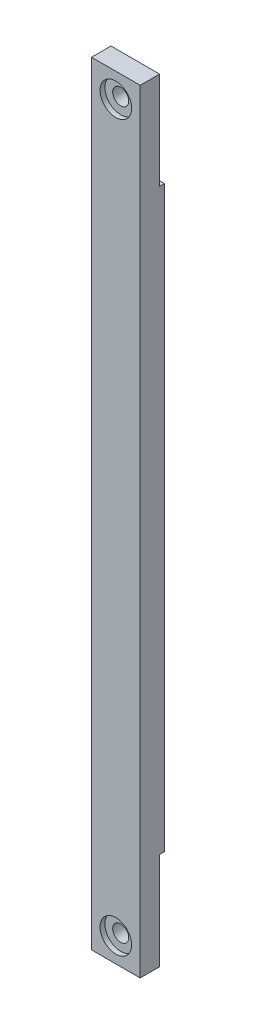
ISO-10303-21;
HEADER;
FILE_DESCRIPTION(('STEP AP214'),'2;1');
FILE_NAME('part.step','',(''),(''),'','','');
FILE_SCHEMA(('AUTOMOTIVE_DESIGN { 1 0 10303 214 1 1 1 1 }'));
ENDSEC;
DATA;
#1=APPLICATION_CONTEXT('core data for automotive mechanical design processes');
#2=APPLICATION_PROTOCOL_DEFINITION('international standard','automotive_design',2000,#1);
#3=PRODUCT_CONTEXT('',#1,'mechanical');
#4=PRODUCT('Part','Part','',(#3));
#5=PRODUCT_RELATED_PRODUCT_CATEGORY('part','',(#4));
#6=PRODUCT_DEFINITION_FORMATION('','',#4);
#7=PRODUCT_DEFINITION_CONTEXT('part definition',#1,'design');
#8=PRODUCT_DEFINITION('design','',#6,#7);
#9=PRODUCT_DEFINITION_SHAPE('','',#8);
#10=(LENGTH_UNIT() NAMED_UNIT(*) SI_UNIT(.MILLI.,.METRE.));
#11=(NAMED_UNIT(*) PLANE_ANGLE_UNIT() SI_UNIT($,.RADIAN.));
#12=(NAMED_UNIT(*) SI_UNIT($,.STERADIAN.) SOLID_ANGLE_UNIT());
#13=UNCERTAINTY_MEASURE_WITH_UNIT(LENGTH_MEASURE(1.E-05),#10,'distance_accuracy_value','');
#14=(GEOMETRIC_REPRESENTATION_CONTEXT(3) GLOBAL_UNCERTAINTY_ASSIGNED_CONTEXT((#13)) GLOBAL_UNIT_ASSIGNED_CONTEXT((#10,
#11,#12)) REPRESENTATION_CONTEXT('',''));
#15=CARTESIAN_POINT('',(0.,0.,0.));
#16=DIRECTION('',(0.,0.,1.));
#17=DIRECTION('',(1.,0.,0.));
#18=AXIS2_PLACEMENT_3D('',#15,#16,#17);
#19=CARTESIAN_POINT('',(5.00000000000001,-154.,5.));
#20=DIRECTION('',(0.,0.,1.));
#21=DIRECTION('',(1.,0.,0.));
#22=AXIS2_PLACEMENT_3D('',#19,#20,#21);
#23=CYLINDRICAL_SURFACE('',#22,1.65);
#24=CARTESIAN_POINT('',(5.00000000000001,-154.,1.));
#25=DIRECTION('',(0.,0.,1.));
#26=DIRECTION('',(1.,0.,0.));
#27=AXIS2_PLACEMENT_3D('',#24,#25,#26);
#28=CIRCLE('',#27,1.65);
#29=CARTESIAN_POINT('',(6.65000000000001,-154.,1.));
#30=VERTEX_POINT('',#29);
#31=EDGE_CURVE('E159',#30,#30,#28,.T.);
#32=ORIENTED_EDGE('',*,*,#31,.F.);
#33=EDGE_LOOP('',(#32));
#34=FACE_BOUND('',#33,.T.);
#35=CARTESIAN_POINT('',(5.00000000000001,-154.,4.));
#36=DIRECTION('',(0.,0.,1.));
#37=DIRECTION('',(1.,0.,0.));
#38=AXIS2_PLACEMENT_3D('',#35,#36,#37);
#39=CIRCLE('',#38,1.65);
#40=CARTESIAN_POINT('',(6.65000000000001,-154.,4.));
#41=VERTEX_POINT('',#40);
#42=EDGE_CURVE('E45',#41,#41,#39,.F.);
#43=ORIENTED_EDGE('',*,*,#42,.F.);
#44=EDGE_LOOP('',(#43));
#45=FACE_BOUND('',#44,.T.);
#46=ADVANCED_FACE('F41',(#34,#45),#23,.F.);
#47=CARTESIAN_POINT('',(5.00000000000001,-5.,5.));
#48=DIRECTION('',(0.,0.,1.));
#49=DIRECTION('',(1.,0.,0.));
#50=AXIS2_PLACEMENT_3D('',#47,#48,#49);
#51=CYLINDRICAL_SURFACE('',#50,1.65);
#52=CARTESIAN_POINT('',(5.00000000000001,-5.,1.));
#53=DIRECTION('',(0.,0.,-1.));
#54=DIRECTION('',(-1.,0.,0.));
#55=AXIS2_PLACEMENT_3D('',#52,#53,#54);
#56=CIRCLE('',#55,1.65);
#57=CARTESIAN_POINT('',(3.35000000000001,-5.,1.));
#58=VERTEX_POINT('',#57);
#59=EDGE_CURVE('E195',#58,#58,#56,.T.);
#60=ORIENTED_EDGE('',*,*,#59,.T.);
#61=EDGE_LOOP('',(#60));
#62=FACE_BOUND('',#61,.T.);
#63=CARTESIAN_POINT('',(5.00000000000001,-5.,4.));
#64=DIRECTION('',(0.,0.,1.));
#65=DIRECTION('',(1.,0.,0.));
#66=AXIS2_PLACEMENT_3D('',#63,#64,#65);
#67=CIRCLE('',#66,1.65);
#68=CARTESIAN_POINT('',(6.65000000000001,-5.,4.));
#69=VERTEX_POINT('',#68);
#70=EDGE_CURVE('E196',#69,#69,#67,.F.);
#71=ORIENTED_EDGE('',*,*,#70,.F.);
#72=EDGE_LOOP('',(#71));
#73=FACE_BOUND('',#72,.T.);
#74=ADVANCED_FACE('F250',(#62,#73),#51,.F.);
#75=CARTESIAN_POINT('',(0.,0.,5.));
#76=DIRECTION('',(0.,-1.,0.));
#77=DIRECTION('',(0.,0.,-1.));
#78=AXIS2_PLACEMENT_3D('',#75,#76,#77);
#79=PLANE('',#78);
#80=DIRECTION('',(1.,0.,0.));
#81=VECTOR('',#80,1.);
#82=CARTESIAN_POINT('',(10.,0.,1.));
#83=LINE('',#82,#81);
#84=CARTESIAN_POINT('',(0.,0.,1.));
#85=VERTEX_POINT('',#84);
#86=CARTESIAN_POINT('',(10.,0.,1.));
#87=VERTEX_POINT('',#86);
#88=EDGE_CURVE('E122',#85,#87,#83,.T.);
#89=ORIENTED_EDGE('',*,*,#88,.F.);
#90=DIRECTION('',(0.,0.,-1.));
#91=VECTOR('',#90,1.);
#92=CARTESIAN_POINT('',(0.,0.,5.));
#93=LINE('',#92,#91);
#94=CARTESIAN_POINT('',(0.,0.,5.));
#95=VERTEX_POINT('',#94);
#96=EDGE_CURVE('E178',#95,#85,#93,.T.);
#97=ORIENTED_EDGE('',*,*,#96,.F.);
#98=DIRECTION('',(-1.,0.,0.));
#99=VECTOR('',#98,1.);
#100=CARTESIAN_POINT('',(0.,0.,5.));
#101=LINE('',#100,#99);
#102=CARTESIAN_POINT('',(10.,0.,5.));
#103=VERTEX_POINT('',#102);
#104=EDGE_CURVE('E175',#103,#95,#101,.T.);
#105=ORIENTED_EDGE('',*,*,#104,.F.);
#106=DIRECTION('',(0.,0.,-1.));
#107=VECTOR('',#106,1.);
#108=CARTESIAN_POINT('',(10.,0.,5.));
#109=LINE('',#108,#107);
#110=EDGE_CURVE('E187',#103,#87,#109,.T.);
#111=ORIENTED_EDGE('',*,*,#110,.T.);
#112=EDGE_LOOP('',(#89,#97,#105,#111));
#113=FACE_BOUND('',#112,.T.);
#114=ADVANCED_FACE('F248',(#113),#79,.F.);
#115=CARTESIAN_POINT('',(0.,0.,5.));
#116=DIRECTION('',(1.,0.,0.));
#117=DIRECTION('',(0.,1.,0.));
#118=AXIS2_PLACEMENT_3D('',#115,#116,#117);
#119=PLANE('',#118);
#120=DIRECTION('',(0.,1.,0.));
#121=VECTOR('',#120,1.);
#122=CARTESIAN_POINT('',(0.,0.,1.));
#123=LINE('',#122,#121);
#124=CARTESIAN_POINT('',(0.,-20.,1.));
#125=VERTEX_POINT('',#124);
#126=EDGE_CURVE('E116',#125,#85,#123,.T.);
#127=ORIENTED_EDGE('',*,*,#126,.F.);
#128=DIRECTION('',(0.,0.,-1.));
#129=VECTOR('',#128,1.);
#130=CARTESIAN_POINT('',(0.,-20.,1.));
#131=LINE('',#130,#129);
#132=CARTESIAN_POINT('',(0.,-20.,0.));
#133=VERTEX_POINT('',#132);
#134=EDGE_CURVE('E112',#125,#133,#131,.T.);
#135=ORIENTED_EDGE('',*,*,#134,.T.);
#136=DIRECTION('',(0.,-1.,0.));
#137=VECTOR('',#136,1.);
#138=CARTESIAN_POINT('',(0.,0.,0.));
#139=LINE('',#138,#137);
#140=CARTESIAN_POINT('',(0.,-139.,0.));
#141=VERTEX_POINT('',#140);
#142=EDGE_CURVE('E138',#133,#141,#139,.T.);
#143=ORIENTED_EDGE('',*,*,#142,.T.);
#144=DIRECTION('',(0.,0.,-1.));
#145=VECTOR('',#144,1.);
#146=CARTESIAN_POINT('',(0.,-139.,1.));
#147=LINE('',#146,#145);
#148=CARTESIAN_POINT('',(0.,-139.,1.));
#149=VERTEX_POINT('',#148);
#150=EDGE_CURVE('E67',#149,#141,#147,.T.);
#151=ORIENTED_EDGE('',*,*,#150,.F.);
#152=DIRECTION('',(0.,1.,0.));
#153=VECTOR('',#152,1.);
#154=CARTESIAN_POINT('',(0.,-159.,1.));
#155=LINE('',#154,#153);
#156=CARTESIAN_POINT('',(0.,-159.,1.));
#157=VERTEX_POINT('',#156);
#158=EDGE_CURVE('E150',#157,#149,#155,.T.);
#159=ORIENTED_EDGE('',*,*,#158,.F.);
#160=DIRECTION('',(0.,0.,-1.));
#161=VECTOR('',#160,1.);
#162=CARTESIAN_POINT('',(0.,-159.,5.));
#163=LINE('',#162,#161);
#164=CARTESIAN_POINT('',(0.,-159.,5.));
#165=VERTEX_POINT('',#164);
#166=EDGE_CURVE('E11',#165,#157,#163,.T.);
#167=ORIENTED_EDGE('',*,*,#166,.F.);
#168=DIRECTION('',(0.,-1.,0.));
#169=VECTOR('',#168,1.);
#170=CARTESIAN_POINT('',(0.,0.,5.));
#171=LINE('',#170,#169);
#172=EDGE_CURVE('E165',#95,#165,#171,.T.);
#173=ORIENTED_EDGE('',*,*,#172,.F.);
#174=ORIENTED_EDGE('',*,*,#96,.T.);
#175=EDGE_LOOP('',(#127,#135,#143,#151,#159,#167,#173,#174));
#176=FACE_BOUND('',#175,.T.);
#177=ADVANCED_FACE('F43',(#176),#119,.F.);
#178=CARTESIAN_POINT('',(0.,-159.,5.));
#179=DIRECTION('',(0.,1.,0.));
#180=DIRECTION('',(0.,0.,1.));
#181=AXIS2_PLACEMENT_3D('',#178,#179,#180);
#182=PLANE('',#181);
#183=ORIENTED_EDGE('',*,*,#166,.T.);
#184=DIRECTION('',(-1.,0.,0.));
#185=VECTOR('',#184,1.);
#186=CARTESIAN_POINT('',(10.,-159.,1.));
#187=LINE('',#186,#185);
#188=CARTESIAN_POINT('',(10.,-159.,1.));
#189=VERTEX_POINT('',#188);
#190=EDGE_CURVE('E146',#189,#157,#187,.T.);
#191=ORIENTED_EDGE('',*,*,#190,.F.);
#192=DIRECTION('',(0.,0.,-1.));
#193=VECTOR('',#192,1.);
#194=CARTESIAN_POINT('',(10.,-159.,5.));
#195=LINE('',#194,#193);
#196=CARTESIAN_POINT('',(10.,-159.,5.));
#197=VERTEX_POINT('',#196);
#198=EDGE_CURVE('E51',#197,#189,#195,.T.);
#199=ORIENTED_EDGE('',*,*,#198,.F.);
#200=DIRECTION('',(1.,0.,0.));
#201=VECTOR('',#200,1.);
#202=CARTESIAN_POINT('',(0.,-159.,5.));
#203=LINE('',#202,#201);
#204=EDGE_CURVE('E169',#165,#197,#203,.T.);
#205=ORIENTED_EDGE('',*,*,#204,.F.);
#206=EDGE_LOOP('',(#183,#191,#199,#205));
#207=FACE_BOUND('',#206,.T.);
#208=ADVANCED_FACE('F240',(#207),#182,.F.);
#209=CARTESIAN_POINT('',(10.,0.,5.));
#210=DIRECTION('',(-1.,0.,0.));
#211=DIRECTION('',(0.,-1.,0.));
#212=AXIS2_PLACEMENT_3D('',#209,#210,#211);
#213=PLANE('',#212);
#214=DIRECTION('',(0.,1.,0.));
#215=VECTOR('',#214,1.);
#216=CARTESIAN_POINT('',(10.,0.,0.));
#217=LINE('',#216,#215);
#218=CARTESIAN_POINT('',(10.,-139.,0.));
#219=VERTEX_POINT('',#218);
#220=CARTESIAN_POINT('',(10.,-20.,0.));
#221=VERTEX_POINT('',#220);
#222=EDGE_CURVE('E133',#219,#221,#217,.T.);
#223=ORIENTED_EDGE('',*,*,#222,.T.);
#224=DIRECTION('',(0.,0.,-1.));
#225=VECTOR('',#224,1.);
#226=CARTESIAN_POINT('',(10.,-20.,1.));
#227=LINE('',#226,#225);
#228=CARTESIAN_POINT('',(10.,-20.,1.));
#229=VERTEX_POINT('',#228);
#230=EDGE_CURVE('E59',#229,#221,#227,.T.);
#231=ORIENTED_EDGE('',*,*,#230,.F.);
#232=DIRECTION('',(0.,-1.,0.));
#233=VECTOR('',#232,1.);
#234=CARTESIAN_POINT('',(10.,0.,1.));
#235=LINE('',#234,#233);
#236=EDGE_CURVE('E117',#87,#229,#235,.T.);
#237=ORIENTED_EDGE('',*,*,#236,.F.);
#238=ORIENTED_EDGE('',*,*,#110,.F.);
#239=DIRECTION('',(0.,1.,0.));
#240=VECTOR('',#239,1.);
#241=CARTESIAN_POINT('',(10.,0.,5.));
#242=LINE('',#241,#240);
#243=EDGE_CURVE('E172',#197,#103,#242,.T.);
#244=ORIENTED_EDGE('',*,*,#243,.F.);
#245=ORIENTED_EDGE('',*,*,#198,.T.);
#246=DIRECTION('',(0.,-1.,0.));
#247=VECTOR('',#246,1.);
#248=CARTESIAN_POINT('',(10.,-159.,1.));
#249=LINE('',#248,#247);
#250=CARTESIAN_POINT('',(10.,-139.,1.));
#251=VERTEX_POINT('',#250);
#252=EDGE_CURVE('E143',#251,#189,#249,.T.);
#253=ORIENTED_EDGE('',*,*,#252,.F.);
#254=DIRECTION('',(0.,0.,-1.));
#255=VECTOR('',#254,1.);
#256=CARTESIAN_POINT('',(10.,-139.,1.));
#257=LINE('',#256,#255);
#258=EDGE_CURVE('E160',#251,#219,#257,.T.);
#259=ORIENTED_EDGE('',*,*,#258,.T.);
#260=EDGE_LOOP('',(#223,#231,#237,#238,#244,#245,#253,#259));
#261=FACE_BOUND('',#260,.T.);
#262=ADVANCED_FACE('F130',(#261),#213,.F.);
#263=CARTESIAN_POINT('',(0.,0.,5.));
#264=DIRECTION('',(0.,0.,1.));
#265=DIRECTION('',(1.,0.,0.));
#266=AXIS2_PLACEMENT_3D('',#263,#264,#265);
#267=PLANE('',#266);
#268=CARTESIAN_POINT('',(5.00000000000001,-5.,5.));
#269=DIRECTION('',(0.,0.,1.));
#270=DIRECTION('',(1.,0.,0.));
#271=AXIS2_PLACEMENT_3D('',#268,#269,#270);
#272=CIRCLE('',#271,3.25);
#273=CARTESIAN_POINT('',(8.25000000000001,-5.,5.));
#274=VERTEX_POINT('',#273);
#275=EDGE_CURVE('E206',#274,#274,#272,.T.);
#276=ORIENTED_EDGE('',*,*,#275,.F.);
#277=EDGE_LOOP('',(#276));
#278=FACE_BOUND('',#277,.T.);
#279=CARTESIAN_POINT('',(5.00000000000001,-154.,5.));
#280=DIRECTION('',(0.,0.,1.));
#281=DIRECTION('',(1.,0.,0.));
#282=AXIS2_PLACEMENT_3D('',#279,#280,#281);
#283=CIRCLE('',#282,3.25);
#284=CARTESIAN_POINT('',(8.25000000000001,-154.,5.));
#285=VERTEX_POINT('',#284);
#286=EDGE_CURVE('E218',#285,#285,#283,.T.);
#287=ORIENTED_EDGE('',*,*,#286,.F.);
#288=EDGE_LOOP('',(#287));
#289=FACE_BOUND('',#288,.T.);
#290=ORIENTED_EDGE('',*,*,#172,.T.);
#291=ORIENTED_EDGE('',*,*,#204,.T.);
#292=ORIENTED_EDGE('',*,*,#243,.T.);
#293=ORIENTED_EDGE('',*,*,#104,.T.);
#294=EDGE_LOOP('',(#290,#291,#292,#293));
#295=FACE_BOUND('',#294,.T.);
#296=ADVANCED_FACE('F245',(#278,#289,#295),#267,.T.);
#297=CARTESIAN_POINT('',(0.,0.,0.));
#298=DIRECTION('',(0.,0.,1.));
#299=DIRECTION('',(1.,0.,0.));
#300=AXIS2_PLACEMENT_3D('',#297,#298,#299);
#301=PLANE('',#300);
#302=ORIENTED_EDGE('',*,*,#142,.F.);
#303=DIRECTION('',(-1.,0.,0.));
#304=VECTOR('',#303,1.);
#305=CARTESIAN_POINT('',(10.,-20.,0.));
#306=LINE('',#305,#304);
#307=EDGE_CURVE('E127',#221,#133,#306,.T.);
#308=ORIENTED_EDGE('',*,*,#307,.F.);
#309=ORIENTED_EDGE('',*,*,#222,.F.);
#310=DIRECTION('',(1.,0.,0.));
#311=VECTOR('',#310,1.);
#312=CARTESIAN_POINT('',(10.,-139.,0.));
#313=LINE('',#312,#311);
#314=EDGE_CURVE('E147',#141,#219,#313,.T.);
#315=ORIENTED_EDGE('',*,*,#314,.F.);
#316=EDGE_LOOP('',(#302,#308,#309,#315));
#317=FACE_BOUND('',#316,.T.);
#318=ADVANCED_FACE('F230',(#317),#301,.F.);
#319=CARTESIAN_POINT('',(10.,-139.,1.));
#320=DIRECTION('',(0.,1.,0.));
#321=DIRECTION('',(0.,0.,1.));
#322=AXIS2_PLACEMENT_3D('',#319,#320,#321);
#323=PLANE('',#322);
#324=ORIENTED_EDGE('',*,*,#314,.T.);
#325=ORIENTED_EDGE('',*,*,#258,.F.);
#326=DIRECTION('',(1.,0.,0.));
#327=VECTOR('',#326,1.);
#328=CARTESIAN_POINT('',(10.,-139.,1.));
#329=LINE('',#328,#327);
#330=EDGE_CURVE('E153',#149,#251,#329,.T.);
#331=ORIENTED_EDGE('',*,*,#330,.F.);
#332=ORIENTED_EDGE('',*,*,#150,.T.);
#333=EDGE_LOOP('',(#324,#325,#331,#332));
#334=FACE_BOUND('',#333,.T.);
#335=ADVANCED_FACE('F231',(#334),#323,.F.);
#336=CARTESIAN_POINT('',(0.,0.,1.));
#337=DIRECTION('',(0.,0.,1.));
#338=DIRECTION('',(1.,0.,0.));
#339=AXIS2_PLACEMENT_3D('',#336,#337,#338);
#340=PLANE('',#339);
#341=ORIENTED_EDGE('',*,*,#31,.T.);
#342=EDGE_LOOP('',(#341));
#343=FACE_BOUND('',#342,.T.);
#344=ORIENTED_EDGE('',*,*,#252,.T.);
#345=ORIENTED_EDGE('',*,*,#190,.T.);
#346=ORIENTED_EDGE('',*,*,#158,.T.);
#347=ORIENTED_EDGE('',*,*,#330,.T.);
#348=EDGE_LOOP('',(#344,#345,#346,#347));
#349=FACE_BOUND('',#348,.T.);
#350=ADVANCED_FACE('F237',(#343,#349),#340,.F.);
#351=CARTESIAN_POINT('',(10.,-20.,1.));
#352=DIRECTION('',(0.,-1.,0.));
#353=DIRECTION('',(0.,0.,-1.));
#354=AXIS2_PLACEMENT_3D('',#351,#352,#353);
#355=PLANE('',#354);
#356=ORIENTED_EDGE('',*,*,#307,.T.);
#357=ORIENTED_EDGE('',*,*,#134,.F.);
#358=DIRECTION('',(-1.,0.,0.));
#359=VECTOR('',#358,1.);
#360=CARTESIAN_POINT('',(10.,-20.,1.));
#361=LINE('',#360,#359);
#362=EDGE_CURVE('E108',#229,#125,#361,.T.);
#363=ORIENTED_EDGE('',*,*,#362,.F.);
#364=ORIENTED_EDGE('',*,*,#230,.T.);
#365=EDGE_LOOP('',(#356,#357,#363,#364));
#366=FACE_BOUND('',#365,.T.);
#367=ADVANCED_FACE('F110',(#366),#355,.F.);
#368=CARTESIAN_POINT('',(0.,0.,1.));
#369=DIRECTION('',(0.,0.,-1.));
#370=DIRECTION('',(-1.,0.,0.));
#371=AXIS2_PLACEMENT_3D('',#368,#369,#370);
#372=PLANE('',#371);
#373=ORIENTED_EDGE('',*,*,#59,.F.);
#374=EDGE_LOOP('',(#373));
#375=FACE_BOUND('',#374,.T.);
#376=ORIENTED_EDGE('',*,*,#236,.T.);
#377=ORIENTED_EDGE('',*,*,#362,.T.);
#378=ORIENTED_EDGE('',*,*,#126,.T.);
#379=ORIENTED_EDGE('',*,*,#88,.T.);
#380=EDGE_LOOP('',(#376,#377,#378,#379));
#381=FACE_BOUND('',#380,.T.);
#382=ADVANCED_FACE('F120',(#375,#381),#372,.T.);
#383=CARTESIAN_POINT('',(5.00000000000001,-5.,4.));
#384=DIRECTION('',(0.,0.,1.));
#385=DIRECTION('',(1.,0.,0.));
#386=AXIS2_PLACEMENT_3D('',#383,#384,#385);
#387=PLANE('',#386);
#388=CARTESIAN_POINT('',(5.00000000000001,-5.,4.));
#389=DIRECTION('',(0.,0.,1.));
#390=DIRECTION('',(1.,0.,0.));
#391=AXIS2_PLACEMENT_3D('',#388,#389,#390);
#392=CIRCLE('',#391,3.25);
#393=CARTESIAN_POINT('',(8.25000000000001,-5.,4.));
#394=VERTEX_POINT('',#393);
#395=EDGE_CURVE('E199',#394,#394,#392,.T.);
#396=ORIENTED_EDGE('',*,*,#395,.T.);
#397=EDGE_LOOP('',(#396));
#398=FACE_BOUND('',#397,.T.);
#399=ORIENTED_EDGE('',*,*,#70,.T.);
#400=EDGE_LOOP('',(#399));
#401=FACE_BOUND('',#400,.T.);
#402=ADVANCED_FACE('F271',(#398,#401),#387,.T.);
#403=CARTESIAN_POINT('',(5.00000000000001,-5.,4.));
#404=DIRECTION('',(0.,0.,1.));
#405=DIRECTION('',(1.,0.,0.));
#406=AXIS2_PLACEMENT_3D('',#403,#404,#405);
#407=CYLINDRICAL_SURFACE('',#406,3.25);
#408=ORIENTED_EDGE('',*,*,#395,.F.);
#409=EDGE_LOOP('',(#408));
#410=FACE_BOUND('',#409,.T.);
#411=ORIENTED_EDGE('',*,*,#275,.T.);
#412=EDGE_LOOP('',(#411));
#413=FACE_BOUND('',#412,.T.);
#414=ADVANCED_FACE('F312',(#410,#413),#407,.F.);
#415=CARTESIAN_POINT('',(5.00000000000001,-154.,4.));
#416=DIRECTION('',(0.,0.,1.));
#417=DIRECTION('',(1.,0.,0.));
#418=AXIS2_PLACEMENT_3D('',#415,#416,#417);
#419=PLANE('',#418);
#420=CARTESIAN_POINT('',(5.00000000000001,-154.,4.));
#421=DIRECTION('',(0.,0.,1.));
#422=DIRECTION('',(1.,0.,0.));
#423=AXIS2_PLACEMENT_3D('',#420,#421,#422);
#424=CIRCLE('',#423,3.25);
#425=CARTESIAN_POINT('',(8.25000000000001,-154.,4.));
#426=VERTEX_POINT('',#425);
#427=EDGE_CURVE('E212',#426,#426,#424,.T.);
#428=ORIENTED_EDGE('',*,*,#427,.T.);
#429=EDGE_LOOP('',(#428));
#430=FACE_BOUND('',#429,.T.);
#431=ORIENTED_EDGE('',*,*,#42,.T.);
#432=EDGE_LOOP('',(#431));
#433=FACE_BOUND('',#432,.T.);
#434=ADVANCED_FACE('F319',(#430,#433),#419,.T.);
#435=CARTESIAN_POINT('',(5.00000000000001,-154.,4.));
#436=DIRECTION('',(0.,0.,1.));
#437=DIRECTION('',(1.,0.,0.));
#438=AXIS2_PLACEMENT_3D('',#435,#436,#437);
#439=CYLINDRICAL_SURFACE('',#438,3.25);
#440=ORIENTED_EDGE('',*,*,#427,.F.);
#441=EDGE_LOOP('',(#440));
#442=FACE_BOUND('',#441,.T.);
#443=ORIENTED_EDGE('',*,*,#286,.T.);
#444=EDGE_LOOP('',(#443));
#445=FACE_BOUND('',#444,.T.);
#446=ADVANCED_FACE('F327',(#442,#445),#439,.F.);
#447=CLOSED_SHELL('',(#46,#74,#114,#177,#208,#262,#296,#318,#335,#350,#367,#382,#402,#414,#434,#446));
#448=MANIFOLD_SOLID_BREP('B2',#447);
#449=ADVANCED_BREP_SHAPE_REPRESENTATION('',(#18,#448),#14);
#450=SHAPE_DEFINITION_REPRESENTATION(#9,#449);
ENDSEC;
END-ISO-10303-21;
